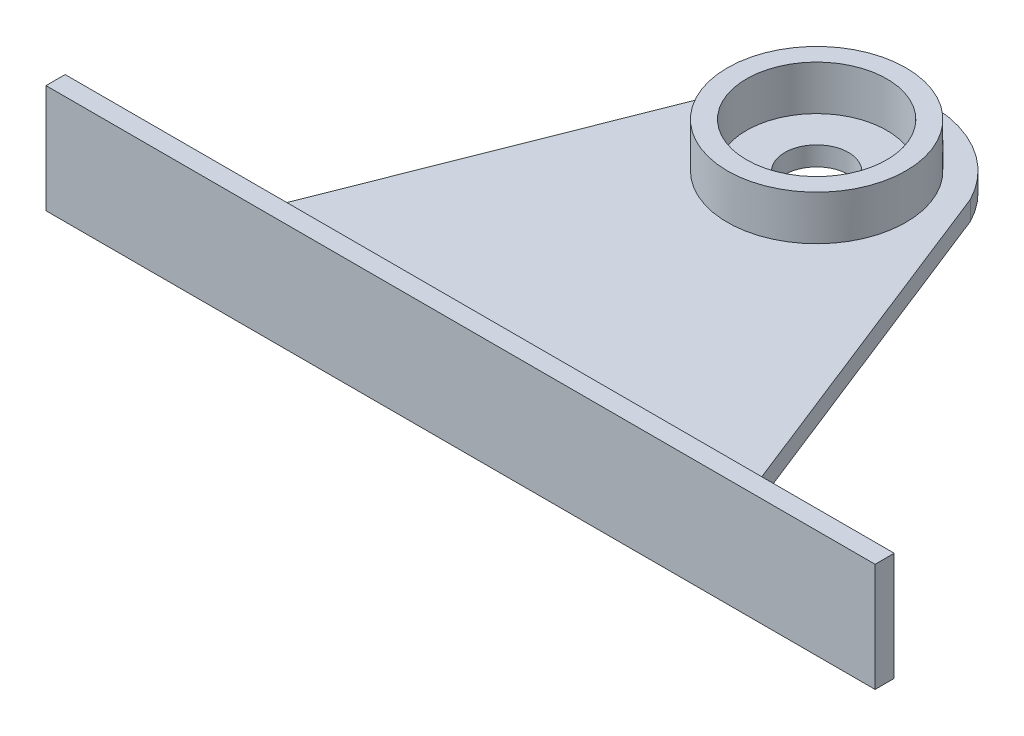
ISO-10303-21;
HEADER;
FILE_DESCRIPTION(('STEP AP214'),'2;1');
FILE_NAME('part.step','',(''),(''),'','','');
FILE_SCHEMA(('AUTOMOTIVE_DESIGN { 1 0 10303 214 1 1 1 1 }'));
ENDSEC;
DATA;
#1=APPLICATION_CONTEXT('core data for automotive mechanical design processes');
#2=APPLICATION_PROTOCOL_DEFINITION('international standard','automotive_design',2000,#1);
#3=PRODUCT_CONTEXT('',#1,'mechanical');
#4=PRODUCT('Part','Part','',(#3));
#5=PRODUCT_RELATED_PRODUCT_CATEGORY('part','',(#4));
#6=PRODUCT_DEFINITION_FORMATION('','',#4);
#7=PRODUCT_DEFINITION_CONTEXT('part definition',#1,'design');
#8=PRODUCT_DEFINITION('design','',#6,#7);
#9=PRODUCT_DEFINITION_SHAPE('','',#8);
#10=(LENGTH_UNIT() NAMED_UNIT(*) SI_UNIT(.MILLI.,.METRE.));
#11=(NAMED_UNIT(*) PLANE_ANGLE_UNIT() SI_UNIT($,.RADIAN.));
#12=(NAMED_UNIT(*) SI_UNIT($,.STERADIAN.) SOLID_ANGLE_UNIT());
#13=UNCERTAINTY_MEASURE_WITH_UNIT(LENGTH_MEASURE(1.E-05),#10,'distance_accuracy_value','');
#14=(GEOMETRIC_REPRESENTATION_CONTEXT(3) GLOBAL_UNCERTAINTY_ASSIGNED_CONTEXT((#13)) GLOBAL_UNIT_ASSIGNED_CONTEXT((#10,
#11,#12)) REPRESENTATION_CONTEXT('',''));
#15=CARTESIAN_POINT('',(0.,0.,0.));
#16=DIRECTION('',(0.,0.,1.));
#17=DIRECTION('',(1.,0.,0.));
#18=AXIS2_PLACEMENT_3D('',#15,#16,#17);
#19=CARTESIAN_POINT('',(-8.92914445149548,3.,-35.0049377267636));
#20=DIRECTION('',(0.,-1.,0.));
#21=DIRECTION('',(0.,0.,-1.));
#22=AXIS2_PLACEMENT_3D('',#19,#20,#21);
#23=PLANE('',#22);
#24=DIRECTION('',(-0.367083952716123,0.,0.930187815260073));
#25=VECTOR('',#24,1.);
#26=CARTESIAN_POINT('',(-24.8438078736417,3.,-43.196988965688));
#27=LINE('',#26,#25);
#28=CARTESIAN_POINT('',(-24.8438078736417,3.,-43.196988965688));
#29=VERTEX_POINT('',#28);
#30=CARTESIAN_POINT('',(-48.9291444514955,3.,17.8350622732364));
#31=VERTEX_POINT('',#30);
#32=EDGE_CURVE('E78',#29,#31,#27,.T.);
#33=ORIENTED_EDGE('',*,*,#32,.T.);
#34=DIRECTION('',(1.,0.,0.));
#35=VECTOR('',#34,1.);
#36=CARTESIAN_POINT('',(-48.9291444514955,3.,17.8350622732364));
#37=LINE('',#36,#35);
#38=CARTESIAN_POINT('',(31.0708555485045,3.,17.8350622732364));
#39=VERTEX_POINT('',#38);
#40=EDGE_CURVE('E149',#31,#39,#37,.T.);
#41=ORIENTED_EDGE('',*,*,#40,.T.);
#42=DIRECTION('',(-0.367083952716123,0.,-0.930187815260073));
#43=VECTOR('',#42,1.);
#44=CARTESIAN_POINT('',(31.0708555485045,3.,17.8350622732364));
#45=LINE('',#44,#43);
#46=CARTESIAN_POINT('',(6.98551897065071,3.,-43.196988965688));
#47=VERTEX_POINT('',#46);
#48=EDGE_CURVE('E151',#39,#47,#45,.T.);
#49=ORIENTED_EDGE('',*,*,#48,.T.);
#50=CARTESIAN_POINT('',(-8.92914445149548,3.,-35.0049377267636));
#51=DIRECTION('',(0.,1.,0.));
#52=DIRECTION('',(0.,0.,-1.));
#53=AXIS2_PLACEMENT_3D('',#50,#51,#52);
#54=CIRCLE('',#53,17.8993356117304);
#55=EDGE_CURVE('E52',#47,#29,#54,.T.);
#56=ORIENTED_EDGE('',*,*,#55,.T.);
#57=EDGE_LOOP('',(#33,#41,#49,#56));
#58=FACE_BOUND('',#57,.T.);
#59=CARTESIAN_POINT('',(-8.92914445149548,3.,-35.0049377267636));
#60=DIRECTION('',(0.,-1.,0.));
#61=DIRECTION('',(0.,0.,-1.));
#62=AXIS2_PLACEMENT_3D('',#59,#60,#61);
#63=CIRCLE('',#62,14.);
#64=CARTESIAN_POINT('',(-8.92914445149548,3.,-49.0049377267636));
#65=VERTEX_POINT('',#64);
#66=EDGE_CURVE('E11',#65,#65,#63,.F.);
#67=ORIENTED_EDGE('',*,*,#66,.F.);
#68=EDGE_LOOP('',(#67));
#69=FACE_BOUND('',#68,.T.);
#70=ADVANCED_FACE('F35',(#58,#69),#23,.F.);
#71=CARTESIAN_POINT('',(-24.8438078736417,3.,-43.196988965688));
#72=DIRECTION('',(0.930187815260072,0.,0.367083952716123));
#73=DIRECTION('',(0.367083952716123,0.,-0.930187815260073));
#74=AXIS2_PLACEMENT_3D('',#71,#72,#73);
#75=PLANE('',#74);
#76=DIRECTION('',(-0.367083952716123,0.,0.930187815260073));
#77=VECTOR('',#76,1.);
#78=CARTESIAN_POINT('',(-24.8438078736417,0.,-43.196988965688));
#79=LINE('',#78,#77);
#80=CARTESIAN_POINT('',(-24.8438078736417,0.,-43.196988965688));
#81=VERTEX_POINT('',#80);
#82=CARTESIAN_POINT('',(-48.9291444514955,0.,17.8350622732364));
#83=VERTEX_POINT('',#82);
#84=EDGE_CURVE('E147',#81,#83,#79,.T.);
#85=ORIENTED_EDGE('',*,*,#84,.T.);
#86=DIRECTION('',(0.,-1.,0.));
#87=VECTOR('',#86,1.);
#88=CARTESIAN_POINT('',(-48.9291444514955,3.,17.8350622732364));
#89=LINE('',#88,#87);
#90=EDGE_CURVE('E44',#31,#83,#89,.T.);
#91=ORIENTED_EDGE('',*,*,#90,.F.);
#92=ORIENTED_EDGE('',*,*,#32,.F.);
#93=DIRECTION('',(0.,-1.,0.));
#94=VECTOR('',#93,1.);
#95=CARTESIAN_POINT('',(-24.8438078736417,3.,-43.196988965688));
#96=LINE('',#95,#94);
#97=EDGE_CURVE('E154',#29,#81,#96,.T.);
#98=ORIENTED_EDGE('',*,*,#97,.T.);
#99=EDGE_LOOP('',(#85,#91,#92,#98));
#100=FACE_BOUND('',#99,.T.);
#101=ADVANCED_FACE('F37',(#100),#75,.F.);
#102=CARTESIAN_POINT('',(31.0708555485045,3.,17.8350622732364));
#103=DIRECTION('',(-0.930187815260072,0.,0.367083952716123));
#104=DIRECTION('',(0.367083952716123,0.,0.930187815260073));
#105=AXIS2_PLACEMENT_3D('',#102,#103,#104);
#106=PLANE('',#105);
#107=DIRECTION('',(-0.367083952716123,0.,-0.930187815260073));
#108=VECTOR('',#107,1.);
#109=CARTESIAN_POINT('',(31.0708555485045,0.,17.8350622732364));
#110=LINE('',#109,#108);
#111=CARTESIAN_POINT('',(31.0708555485045,0.,17.8350622732364));
#112=VERTEX_POINT('',#111);
#113=CARTESIAN_POINT('',(6.98551897065071,0.,-43.196988965688));
#114=VERTEX_POINT('',#113);
#115=EDGE_CURVE('E67',#112,#114,#110,.T.);
#116=ORIENTED_EDGE('',*,*,#115,.T.);
#117=DIRECTION('',(0.,-1.,0.));
#118=VECTOR('',#117,1.);
#119=CARTESIAN_POINT('',(6.98551897065071,3.,-43.196988965688));
#120=LINE('',#119,#118);
#121=EDGE_CURVE('E163',#47,#114,#120,.T.);
#122=ORIENTED_EDGE('',*,*,#121,.F.);
#123=ORIENTED_EDGE('',*,*,#48,.F.);
#124=DIRECTION('',(0.,-1.,0.));
#125=VECTOR('',#124,1.);
#126=CARTESIAN_POINT('',(31.0708555485045,3.,17.8350622732364));
#127=LINE('',#126,#125);
#128=EDGE_CURVE('E165',#39,#112,#127,.T.);
#129=ORIENTED_EDGE('',*,*,#128,.T.);
#130=EDGE_LOOP('',(#116,#122,#123,#129));
#131=FACE_BOUND('',#130,.T.);
#132=ADVANCED_FACE('F176',(#131),#106,.F.);
#133=CARTESIAN_POINT('',(-8.92914445149548,3.,-35.0049377267636));
#134=DIRECTION('',(0.,-1.,0.));
#135=DIRECTION('',(0.,0.,-1.));
#136=AXIS2_PLACEMENT_3D('',#133,#134,#135);
#137=CYLINDRICAL_SURFACE('',#136,17.8993356117304);
#138=CARTESIAN_POINT('',(-8.92914445149548,0.,-35.0049377267636));
#139=DIRECTION('',(0.,1.,0.));
#140=DIRECTION('',(0.,0.,-1.));
#141=AXIS2_PLACEMENT_3D('',#138,#139,#140);
#142=CIRCLE('',#141,17.8993356117304);
#143=EDGE_CURVE('E73',#114,#81,#142,.T.);
#144=ORIENTED_EDGE('',*,*,#143,.T.);
#145=ORIENTED_EDGE('',*,*,#97,.F.);
#146=ORIENTED_EDGE('',*,*,#55,.F.);
#147=ORIENTED_EDGE('',*,*,#121,.T.);
#148=EDGE_LOOP('',(#144,#145,#146,#147));
#149=FACE_BOUND('',#148,.T.);
#150=ADVANCED_FACE('F203',(#149),#137,.T.);
#151=CARTESIAN_POINT('',(-8.92914445149548,0.,-35.0049377267636));
#152=DIRECTION('',(0.,-1.,0.));
#153=DIRECTION('',(0.,0.,-1.));
#154=AXIS2_PLACEMENT_3D('',#151,#152,#153);
#155=PLANE('',#154);
#156=CARTESIAN_POINT('',(-8.92914445149548,0.,-35.0049377267636));
#157=DIRECTION('',(0.,-1.,0.));
#158=DIRECTION('',(0.,0.,-1.));
#159=AXIS2_PLACEMENT_3D('',#156,#157,#158);
#160=CIRCLE('',#159,5.);
#161=CARTESIAN_POINT('',(-8.92914445149548,0.,-40.0049377267636));
#162=VERTEX_POINT('',#161);
#163=EDGE_CURVE('E318',#162,#162,#160,.T.);
#164=ORIENTED_EDGE('',*,*,#163,.F.);
#165=EDGE_LOOP('',(#164));
#166=FACE_BOUND('',#165,.T.);
#167=ORIENTED_EDGE('',*,*,#84,.F.);
#168=ORIENTED_EDGE('',*,*,#143,.F.);
#169=ORIENTED_EDGE('',*,*,#115,.F.);
#170=DIRECTION('',(1.,0.,0.));
#171=VECTOR('',#170,1.);
#172=CARTESIAN_POINT('',(-48.9291444514955,0.,17.8350622732364));
#173=LINE('',#172,#171);
#174=EDGE_CURVE('E157',#83,#112,#173,.T.);
#175=ORIENTED_EDGE('',*,*,#174,.F.);
#176=EDGE_LOOP('',(#167,#168,#169,#175));
#177=FACE_BOUND('',#176,.T.);
#178=ADVANCED_FACE('F174',(#166,#177),#155,.T.);
#179=CARTESIAN_POINT('',(-8.92914445149548,10.,-35.0049377267636));
#180=DIRECTION('',(0.,1.,0.));
#181=DIRECTION('',(0.,0.,1.));
#182=AXIS2_PLACEMENT_3D('',#179,#180,#181);
#183=PLANE('',#182);
#184=CARTESIAN_POINT('',(-8.92914445149548,10.,-35.0049377267636));
#185=DIRECTION('',(0.,1.,0.));
#186=DIRECTION('',(0.,0.,1.));
#187=AXIS2_PLACEMENT_3D('',#184,#185,#186);
#188=CIRCLE('',#187,14.);
#189=CARTESIAN_POINT('',(-8.92914445149548,10.,-21.0049377267636));
#190=VERTEX_POINT('',#189);
#191=EDGE_CURVE('E143',#190,#190,#188,.T.);
#192=ORIENTED_EDGE('',*,*,#191,.T.);
#193=EDGE_LOOP('',(#192));
#194=FACE_BOUND('',#193,.T.);
#195=CARTESIAN_POINT('',(-8.92914445149548,10.,-35.0049377267636));
#196=DIRECTION('',(0.,1.,0.));
#197=DIRECTION('',(0.,0.,1.));
#198=AXIS2_PLACEMENT_3D('',#195,#196,#197);
#199=CIRCLE('',#198,11.);
#200=CARTESIAN_POINT('',(-8.92914445149548,10.,-24.0049377267636));
#201=VERTEX_POINT('',#200);
#202=EDGE_CURVE('E136',#201,#201,#199,.T.);
#203=ORIENTED_EDGE('',*,*,#202,.F.);
#204=EDGE_LOOP('',(#203));
#205=FACE_BOUND('',#204,.T.);
#206=ADVANCED_FACE('F186',(#194,#205),#183,.T.);
#207=CARTESIAN_POINT('',(-8.92914445149548,10.,-35.0049377267636));
#208=DIRECTION('',(0.,-1.,0.));
#209=DIRECTION('',(0.,0.,-1.));
#210=AXIS2_PLACEMENT_3D('',#207,#208,#209);
#211=CYLINDRICAL_SURFACE('',#210,14.);
#212=ORIENTED_EDGE('',*,*,#191,.F.);
#213=EDGE_LOOP('',(#212));
#214=FACE_BOUND('',#213,.T.);
#215=ORIENTED_EDGE('',*,*,#66,.T.);
#216=EDGE_LOOP('',(#215));
#217=FACE_BOUND('',#216,.T.);
#218=ADVANCED_FACE('F183',(#214,#217),#211,.T.);
#219=CARTESIAN_POINT('',(-8.92914445149548,10.,-35.0049377267636));
#220=DIRECTION('',(0.,-1.,0.));
#221=DIRECTION('',(0.,0.,-1.));
#222=AXIS2_PLACEMENT_3D('',#219,#220,#221);
#223=CYLINDRICAL_SURFACE('',#222,11.);
#224=ORIENTED_EDGE('',*,*,#202,.T.);
#225=EDGE_LOOP('',(#224));
#226=FACE_BOUND('',#225,.T.);
#227=CARTESIAN_POINT('',(-8.92914445149548,3.,-35.0049377267636));
#228=DIRECTION('',(0.,1.,0.));
#229=DIRECTION('',(0.,0.,1.));
#230=AXIS2_PLACEMENT_3D('',#227,#228,#229);
#231=CIRCLE('',#230,11.);
#232=CARTESIAN_POINT('',(-8.92914445149548,3.,-24.0049377267636));
#233=VERTEX_POINT('',#232);
#234=EDGE_CURVE('E133',#233,#233,#231,.T.);
#235=ORIENTED_EDGE('',*,*,#234,.F.);
#236=EDGE_LOOP('',(#235));
#237=FACE_BOUND('',#236,.T.);
#238=ADVANCED_FACE('F185',(#226,#237),#223,.F.);
#239=CARTESIAN_POINT('',(-8.92914445149548,3.,-35.0049377267636));
#240=DIRECTION('',(0.,1.,0.));
#241=DIRECTION('',(0.,0.,1.));
#242=AXIS2_PLACEMENT_3D('',#239,#240,#241);
#243=CIRCLE('',#242,5.);
#244=CARTESIAN_POINT('',(-8.92914445149548,3.,-30.0049377267636));
#245=VERTEX_POINT('',#244);
#246=EDGE_CURVE('E323',#245,#245,#243,.T.);
#247=ORIENTED_EDGE('',*,*,#246,.F.);
#248=EDGE_LOOP('',(#247));
#249=FACE_BOUND('',#248,.T.);
#250=ORIENTED_EDGE('',*,*,#234,.T.);
#251=EDGE_LOOP('',(#250));
#252=FACE_BOUND('',#251,.T.);
#253=ADVANCED_FACE('F180',(#249,#252),#23,.F.);
#254=CARTESIAN_POINT('',(0.,0.,17.8350622732364));
#255=DIRECTION('',(0.,0.,-1.));
#256=DIRECTION('',(-1.,0.,0.));
#257=AXIS2_PLACEMENT_3D('',#254,#255,#256);
#258=PLANE('',#257);
#259=DIRECTION('',(0.,-1.,0.));
#260=VECTOR('',#259,1.);
#261=CARTESIAN_POINT('',(-73.9291444514955,-7.,17.8350622732364));
#262=LINE('',#261,#260);
#263=CARTESIAN_POINT('',(-73.9291444514955,10.,17.8350622732364));
#264=VERTEX_POINT('',#263);
#265=CARTESIAN_POINT('',(-73.9291444514955,-7.,17.8350622732364));
#266=VERTEX_POINT('',#265);
#267=EDGE_CURVE('E132',#264,#266,#262,.T.);
#268=ORIENTED_EDGE('',*,*,#267,.F.);
#269=DIRECTION('',(-1.,0.,0.));
#270=VECTOR('',#269,1.);
#271=CARTESIAN_POINT('',(-73.9291444514955,10.,17.8350622732364));
#272=LINE('',#271,#270);
#273=CARTESIAN_POINT('',(56.0708555485045,10.,17.8350622732364));
#274=VERTEX_POINT('',#273);
#275=EDGE_CURVE('E128',#274,#264,#272,.T.);
#276=ORIENTED_EDGE('',*,*,#275,.F.);
#277=DIRECTION('',(0.,1.,0.));
#278=VECTOR('',#277,1.);
#279=CARTESIAN_POINT('',(56.0708555485045,-7.,17.8350622732364));
#280=LINE('',#279,#278);
#281=CARTESIAN_POINT('',(56.0708555485045,-7.,17.8350622732364));
#282=VERTEX_POINT('',#281);
#283=EDGE_CURVE('E320',#282,#274,#280,.T.);
#284=ORIENTED_EDGE('',*,*,#283,.F.);
#285=DIRECTION('',(1.,0.,0.));
#286=VECTOR('',#285,1.);
#287=CARTESIAN_POINT('',(-73.9291444514955,-7.,17.8350622732364));
#288=LINE('',#287,#286);
#289=EDGE_CURVE('E317',#266,#282,#288,.T.);
#290=ORIENTED_EDGE('',*,*,#289,.F.);
#291=EDGE_LOOP('',(#268,#276,#284,#290));
#292=FACE_BOUND('',#291,.T.);
#293=ORIENTED_EDGE('',*,*,#40,.F.);
#294=ORIENTED_EDGE('',*,*,#90,.T.);
#295=ORIENTED_EDGE('',*,*,#174,.T.);
#296=ORIENTED_EDGE('',*,*,#128,.F.);
#297=EDGE_LOOP('',(#293,#294,#295,#296));
#298=FACE_BOUND('',#297,.T.);
#299=ADVANCED_FACE('F169',(#292,#298),#258,.T.);
#300=CARTESIAN_POINT('',(-73.9291444514955,-7.,20.8350622732364));
#301=DIRECTION('',(1.,0.,0.));
#302=DIRECTION('',(0.,0.,-1.));
#303=AXIS2_PLACEMENT_3D('',#300,#301,#302);
#304=PLANE('',#303);
#305=ORIENTED_EDGE('',*,*,#267,.T.);
#306=DIRECTION('',(0.,0.,-1.));
#307=VECTOR('',#306,1.);
#308=CARTESIAN_POINT('',(-73.9291444514955,-7.,20.8350622732364));
#309=LINE('',#308,#307);
#310=CARTESIAN_POINT('',(-73.9291444514955,-7.,20.8350622732364));
#311=VERTEX_POINT('',#310);
#312=EDGE_CURVE('E112',#311,#266,#309,.T.);
#313=ORIENTED_EDGE('',*,*,#312,.F.);
#314=DIRECTION('',(0.,-1.,0.));
#315=VECTOR('',#314,1.);
#316=CARTESIAN_POINT('',(-73.9291444514955,-7.,20.8350622732364));
#317=LINE('',#316,#315);
#318=CARTESIAN_POINT('',(-73.9291444514955,10.,20.8350622732364));
#319=VERTEX_POINT('',#318);
#320=EDGE_CURVE('E119',#319,#311,#317,.T.);
#321=ORIENTED_EDGE('',*,*,#320,.F.);
#322=DIRECTION('',(0.,0.,-1.));
#323=VECTOR('',#322,1.);
#324=CARTESIAN_POINT('',(-73.9291444514955,10.,20.8350622732364));
#325=LINE('',#324,#323);
#326=EDGE_CURVE('E330',#319,#264,#325,.T.);
#327=ORIENTED_EDGE('',*,*,#326,.T.);
#328=EDGE_LOOP('',(#305,#313,#321,#327));
#329=FACE_BOUND('',#328,.T.);
#330=ADVANCED_FACE('F130',(#329),#304,.F.);
#331=CARTESIAN_POINT('',(-73.9291444514955,-7.,20.8350622732364));
#332=DIRECTION('',(0.,1.,0.));
#333=DIRECTION('',(0.,0.,1.));
#334=AXIS2_PLACEMENT_3D('',#331,#332,#333);
#335=PLANE('',#334);
#336=ORIENTED_EDGE('',*,*,#289,.T.);
#337=DIRECTION('',(0.,0.,-1.));
#338=VECTOR('',#337,1.);
#339=CARTESIAN_POINT('',(56.0708555485045,-7.,20.8350622732364));
#340=LINE('',#339,#338);
#341=CARTESIAN_POINT('',(56.0708555485045,-7.,20.8350622732364));
#342=VERTEX_POINT('',#341);
#343=EDGE_CURVE('E115',#342,#282,#340,.T.);
#344=ORIENTED_EDGE('',*,*,#343,.F.);
#345=DIRECTION('',(1.,0.,0.));
#346=VECTOR('',#345,1.);
#347=CARTESIAN_POINT('',(-73.9291444514955,-7.,20.8350622732364));
#348=LINE('',#347,#346);
#349=EDGE_CURVE('E108',#311,#342,#348,.T.);
#350=ORIENTED_EDGE('',*,*,#349,.F.);
#351=ORIENTED_EDGE('',*,*,#312,.T.);
#352=EDGE_LOOP('',(#336,#344,#350,#351));
#353=FACE_BOUND('',#352,.T.);
#354=ADVANCED_FACE('F110',(#353),#335,.F.);
#355=CARTESIAN_POINT('',(56.0708555485045,-7.,20.8350622732364));
#356=DIRECTION('',(-1.,0.,0.));
#357=DIRECTION('',(0.,0.,1.));
#358=AXIS2_PLACEMENT_3D('',#355,#356,#357);
#359=PLANE('',#358);
#360=ORIENTED_EDGE('',*,*,#283,.T.);
#361=DIRECTION('',(0.,0.,-1.));
#362=VECTOR('',#361,1.);
#363=CARTESIAN_POINT('',(56.0708555485045,10.,20.8350622732364));
#364=LINE('',#363,#362);
#365=CARTESIAN_POINT('',(56.0708555485045,10.,20.8350622732364));
#366=VERTEX_POINT('',#365);
#367=EDGE_CURVE('E138',#366,#274,#364,.T.);
#368=ORIENTED_EDGE('',*,*,#367,.F.);
#369=DIRECTION('',(0.,1.,0.));
#370=VECTOR('',#369,1.);
#371=CARTESIAN_POINT('',(56.0708555485045,-7.,20.8350622732364));
#372=LINE('',#371,#370);
#373=EDGE_CURVE('E118',#342,#366,#372,.T.);
#374=ORIENTED_EDGE('',*,*,#373,.F.);
#375=ORIENTED_EDGE('',*,*,#343,.T.);
#376=EDGE_LOOP('',(#360,#368,#374,#375));
#377=FACE_BOUND('',#376,.T.);
#378=ADVANCED_FACE('F276',(#377),#359,.F.);
#379=CARTESIAN_POINT('',(-73.9291444514955,10.,20.8350622732364));
#380=DIRECTION('',(0.,-1.,0.));
#381=DIRECTION('',(0.,0.,-1.));
#382=AXIS2_PLACEMENT_3D('',#379,#380,#381);
#383=PLANE('',#382);
#384=ORIENTED_EDGE('',*,*,#275,.T.);
#385=ORIENTED_EDGE('',*,*,#326,.F.);
#386=DIRECTION('',(-1.,0.,0.));
#387=VECTOR('',#386,1.);
#388=CARTESIAN_POINT('',(-73.9291444514955,10.,20.8350622732364));
#389=LINE('',#388,#387);
#390=EDGE_CURVE('E124',#366,#319,#389,.T.);
#391=ORIENTED_EDGE('',*,*,#390,.F.);
#392=ORIENTED_EDGE('',*,*,#367,.T.);
#393=EDGE_LOOP('',(#384,#385,#391,#392));
#394=FACE_BOUND('',#393,.T.);
#395=ADVANCED_FACE('F272',(#394),#383,.F.);
#396=CARTESIAN_POINT('',(0.,0.,20.8350622732364));
#397=DIRECTION('',(0.,0.,-1.));
#398=DIRECTION('',(-1.,0.,0.));
#399=AXIS2_PLACEMENT_3D('',#396,#397,#398);
#400=PLANE('',#399);
#401=ORIENTED_EDGE('',*,*,#320,.T.);
#402=ORIENTED_EDGE('',*,*,#349,.T.);
#403=ORIENTED_EDGE('',*,*,#373,.T.);
#404=ORIENTED_EDGE('',*,*,#390,.T.);
#405=EDGE_LOOP('',(#401,#402,#403,#404));
#406=FACE_BOUND('',#405,.T.);
#407=ADVANCED_FACE('F122',(#406),#400,.F.);
#408=CARTESIAN_POINT('',(-8.92914445149548,-7.,-35.0049377267636));
#409=DIRECTION('',(0.,1.,0.));
#410=DIRECTION('',(0.,0.,1.));
#411=AXIS2_PLACEMENT_3D('',#408,#409,#410);
#412=CYLINDRICAL_SURFACE('',#411,5.);
#413=ORIENTED_EDGE('',*,*,#163,.T.);
#414=EDGE_LOOP('',(#413));
#415=FACE_BOUND('',#414,.T.);
#416=ORIENTED_EDGE('',*,*,#246,.T.);
#417=EDGE_LOOP('',(#416));
#418=FACE_BOUND('',#417,.T.);
#419=ADVANCED_FACE('F261',(#415,#418),#412,.F.);
#420=CLOSED_SHELL('',(#70,#101,#132,#150,#178,#206,#218,#238,#253,#299,#330,#354,#378,#395,#407,#419));
#421=MANIFOLD_SOLID_BREP('B2',#420);
#422=ADVANCED_BREP_SHAPE_REPRESENTATION('',(#18,#421),#14);
#423=SHAPE_DEFINITION_REPRESENTATION(#9,#422);
ENDSEC;
END-ISO-10303-21;
